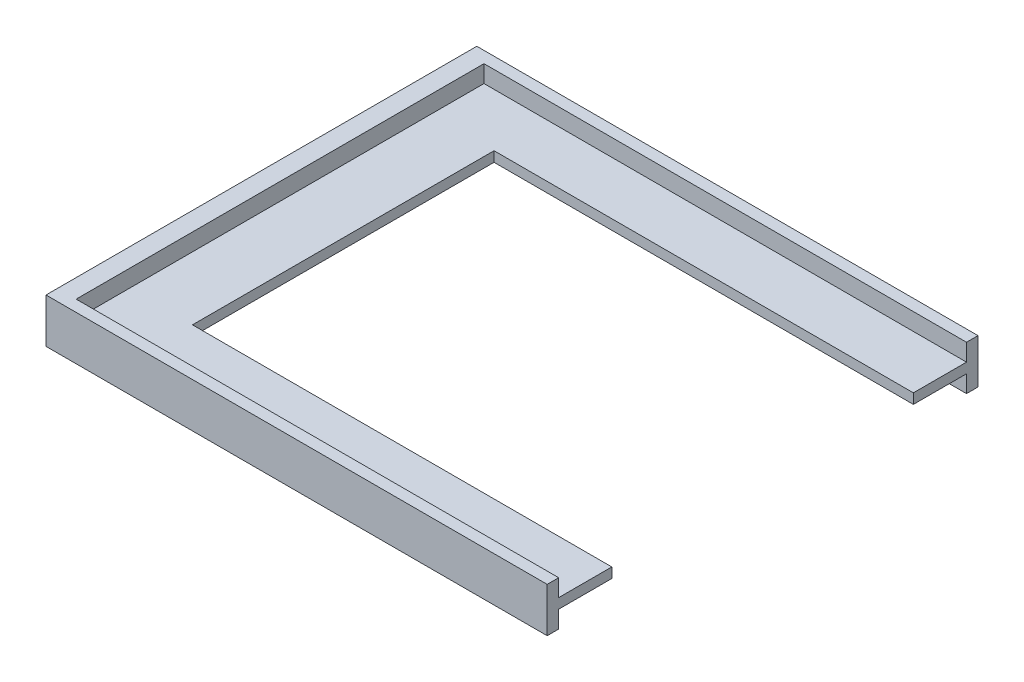
ISO-10303-21;
HEADER;
FILE_DESCRIPTION(('STEP AP214'),'2;1');
FILE_NAME('part.step','',(''),(''),'','','');
FILE_SCHEMA(('AUTOMOTIVE_DESIGN { 1 0 10303 214 1 1 1 1 }'));
ENDSEC;
DATA;
#1=APPLICATION_CONTEXT('core data for automotive mechanical design processes');
#2=APPLICATION_PROTOCOL_DEFINITION('international standard','automotive_design',2000,#1);
#3=PRODUCT_CONTEXT('',#1,'mechanical');
#4=PRODUCT('Part','Part','',(#3));
#5=PRODUCT_RELATED_PRODUCT_CATEGORY('part','',(#4));
#6=PRODUCT_DEFINITION_FORMATION('','',#4);
#7=PRODUCT_DEFINITION_CONTEXT('part definition',#1,'design');
#8=PRODUCT_DEFINITION('design','',#6,#7);
#9=PRODUCT_DEFINITION_SHAPE('','',#8);
#10=(LENGTH_UNIT() NAMED_UNIT(*) SI_UNIT(.MILLI.,.METRE.));
#11=(NAMED_UNIT(*) PLANE_ANGLE_UNIT() SI_UNIT($,.RADIAN.));
#12=(NAMED_UNIT(*) SI_UNIT($,.STERADIAN.) SOLID_ANGLE_UNIT());
#13=UNCERTAINTY_MEASURE_WITH_UNIT(LENGTH_MEASURE(1.E-05),#10,'distance_accuracy_value','');
#14=(GEOMETRIC_REPRESENTATION_CONTEXT(3) GLOBAL_UNCERTAINTY_ASSIGNED_CONTEXT((#13)) GLOBAL_UNIT_ASSIGNED_CONTEXT((#10,
#11,#12)) REPRESENTATION_CONTEXT('',''));
#15=CARTESIAN_POINT('',(0.,0.,0.));
#16=DIRECTION('',(0.,0.,1.));
#17=DIRECTION('',(1.,0.,0.));
#18=AXIS2_PLACEMENT_3D('',#15,#16,#17);
#19=CARTESIAN_POINT('',(-53.,1.4,0.));
#20=DIRECTION('',(-1.,0.,0.));
#21=DIRECTION('',(0.,0.,1.));
#22=AXIS2_PLACEMENT_3D('',#19,#20,#21);
#23=PLANE('',#22);
#24=DIRECTION('',(0.,0.,-1.));
#25=VECTOR('',#24,1.);
#26=CARTESIAN_POINT('',(-53.,0.,0.));
#27=LINE('',#26,#25);
#28=CARTESIAN_POINT('',(-53.,0.,0.));
#29=VERTEX_POINT('',#28);
#30=CARTESIAN_POINT('',(-53.,0.,-42.));
#31=VERTEX_POINT('',#30);
#32=EDGE_CURVE('E227',#29,#31,#27,.T.);
#33=ORIENTED_EDGE('',*,*,#32,.T.);
#34=DIRECTION('',(0.,-1.,0.));
#35=VECTOR('',#34,1.);
#36=CARTESIAN_POINT('',(-53.,1.4,-42.));
#37=LINE('',#36,#35);
#38=CARTESIAN_POINT('',(-53.,1.4,-42.));
#39=VERTEX_POINT('',#38);
#40=EDGE_CURVE('E261',#39,#31,#37,.T.);
#41=ORIENTED_EDGE('',*,*,#40,.F.);
#42=DIRECTION('',(0.,0.,-1.));
#43=VECTOR('',#42,1.);
#44=CARTESIAN_POINT('',(-53.,1.4,0.));
#45=LINE('',#44,#43);
#46=CARTESIAN_POINT('',(-53.,1.4,0.));
#47=VERTEX_POINT('',#46);
#48=EDGE_CURVE('E231',#47,#39,#45,.T.);
#49=ORIENTED_EDGE('',*,*,#48,.F.);
#50=DIRECTION('',(0.,-1.,0.));
#51=VECTOR('',#50,1.);
#52=CARTESIAN_POINT('',(-53.,1.4,0.));
#53=LINE('',#52,#51);
#54=EDGE_CURVE('E264',#47,#29,#53,.T.);
#55=ORIENTED_EDGE('',*,*,#54,.T.);
#56=EDGE_LOOP('',(#33,#41,#49,#55));
#57=FACE_BOUND('',#56,.T.);
#58=ADVANCED_FACE('F37',(#57),#23,.F.);
#59=CARTESIAN_POINT('',(0.,1.4,-42.));
#60=DIRECTION('',(0.,0.,-1.));
#61=DIRECTION('',(-1.,0.,0.));
#62=AXIS2_PLACEMENT_3D('',#59,#60,#61);
#63=PLANE('',#62);
#64=DIRECTION('',(1.,0.,0.));
#65=VECTOR('',#64,1.);
#66=CARTESIAN_POINT('',(0.,0.,-42.));
#67=LINE('',#66,#65);
#68=CARTESIAN_POINT('',(5.4,0.,-42.));
#69=VERTEX_POINT('',#68);
#70=EDGE_CURVE('E243',#31,#69,#67,.T.);
#71=ORIENTED_EDGE('',*,*,#70,.T.);
#72=DIRECTION('',(0.,-1.,0.));
#73=VECTOR('',#72,1.);
#74=CARTESIAN_POINT('',(5.4,1.4,-42.));
#75=LINE('',#74,#73);
#76=CARTESIAN_POINT('',(5.4,1.4,-42.));
#77=VERTEX_POINT('',#76);
#78=EDGE_CURVE('E258',#77,#69,#75,.T.);
#79=ORIENTED_EDGE('',*,*,#78,.F.);
#80=DIRECTION('',(1.,0.,0.));
#81=VECTOR('',#80,1.);
#82=CARTESIAN_POINT('',(-53.,1.4,-42.));
#83=LINE('',#82,#81);
#84=EDGE_CURVE('E234',#39,#77,#83,.T.);
#85=ORIENTED_EDGE('',*,*,#84,.F.);
#86=ORIENTED_EDGE('',*,*,#40,.T.);
#87=EDGE_LOOP('',(#71,#79,#85,#86));
#88=FACE_BOUND('',#87,.T.);
#89=ADVANCED_FACE('F322',(#88),#63,.F.);
#90=CARTESIAN_POINT('',(5.4,1.4,-51.));
#91=DIRECTION('',(-1.,0.,0.));
#92=DIRECTION('',(0.,0.,1.));
#93=AXIS2_PLACEMENT_3D('',#90,#91,#92);
#94=PLANE('',#93);
#95=DIRECTION('',(0.,0.,-1.));
#96=VECTOR('',#95,1.);
#97=CARTESIAN_POINT('',(5.4,0.,-51.));
#98=LINE('',#97,#96);
#99=CARTESIAN_POINT('',(5.4,0.,-49.4));
#100=VERTEX_POINT('',#99);
#101=EDGE_CURVE('E246',#69,#100,#98,.T.);
#102=ORIENTED_EDGE('',*,*,#101,.T.);
#103=DIRECTION('',(0.,1.,0.));
#104=VECTOR('',#103,1.);
#105=CARTESIAN_POINT('',(5.4,-2.4,-49.4));
#106=LINE('',#105,#104);
#107=CARTESIAN_POINT('',(5.4,-2.4,-49.4));
#108=VERTEX_POINT('',#107);
#109=EDGE_CURVE('E209',#108,#100,#106,.T.);
#110=ORIENTED_EDGE('',*,*,#109,.F.);
#111=DIRECTION('',(0.,0.,-1.));
#112=VECTOR('',#111,1.);
#113=CARTESIAN_POINT('',(5.4,-2.4,-51.));
#114=LINE('',#113,#112);
#115=CARTESIAN_POINT('',(5.4,-2.4,-51.));
#116=VERTEX_POINT('',#115);
#117=EDGE_CURVE('E202',#108,#116,#114,.T.);
#118=ORIENTED_EDGE('',*,*,#117,.T.);
#119=DIRECTION('',(0.,-1.,0.));
#120=VECTOR('',#119,1.);
#121=CARTESIAN_POINT('',(5.4,1.4,-51.));
#122=LINE('',#121,#120);
#123=CARTESIAN_POINT('',(5.4,3.8,-51.));
#124=VERTEX_POINT('',#123);
#125=EDGE_CURVE('E256',#124,#116,#122,.T.);
#126=ORIENTED_EDGE('',*,*,#125,.F.);
#127=DIRECTION('',(0.,0.,-1.));
#128=VECTOR('',#127,1.);
#129=CARTESIAN_POINT('',(5.4,3.8,-51.));
#130=LINE('',#129,#128);
#131=CARTESIAN_POINT('',(5.4,3.8,-49.4));
#132=VERTEX_POINT('',#131);
#133=EDGE_CURVE('E184',#132,#124,#130,.T.);
#134=ORIENTED_EDGE('',*,*,#133,.F.);
#135=CARTESIAN_POINT('',(5.4,1.4,-49.4));
#136=VERTEX_POINT('',#135);
#137=EDGE_CURVE('E212',#136,#132,#106,.T.);
#138=ORIENTED_EDGE('',*,*,#137,.F.);
#139=DIRECTION('',(0.,0.,-1.));
#140=VECTOR('',#139,1.);
#141=CARTESIAN_POINT('',(5.4,1.4,-42.));
#142=LINE('',#141,#140);
#143=EDGE_CURVE('E236',#77,#136,#142,.T.);
#144=ORIENTED_EDGE('',*,*,#143,.F.);
#145=ORIENTED_EDGE('',*,*,#78,.T.);
#146=EDGE_LOOP('',(#102,#110,#118,#126,#134,#138,#144,#145));
#147=FACE_BOUND('',#146,.T.);
#148=ADVANCED_FACE('F307',(#147),#94,.F.);
#149=CARTESIAN_POINT('',(-64.4,1.4,-51.));
#150=DIRECTION('',(0.,0.,1.));
#151=DIRECTION('',(1.,0.,0.));
#152=AXIS2_PLACEMENT_3D('',#149,#150,#151);
#153=PLANE('',#152);
#154=ORIENTED_EDGE('',*,*,#125,.T.);
#155=DIRECTION('',(-1.,0.,0.));
#156=VECTOR('',#155,1.);
#157=CARTESIAN_POINT('',(-64.4,-2.4,-51.));
#158=LINE('',#157,#156);
#159=CARTESIAN_POINT('',(-64.4,-2.4,-51.));
#160=VERTEX_POINT('',#159);
#161=EDGE_CURVE('E205',#116,#160,#158,.T.);
#162=ORIENTED_EDGE('',*,*,#161,.T.);
#163=DIRECTION('',(0.,-1.,0.));
#164=VECTOR('',#163,1.);
#165=CARTESIAN_POINT('',(-64.4,1.4,-51.));
#166=LINE('',#165,#164);
#167=CARTESIAN_POINT('',(-64.4,3.8,-51.));
#168=VERTEX_POINT('',#167);
#169=EDGE_CURVE('E156',#168,#160,#166,.T.);
#170=ORIENTED_EDGE('',*,*,#169,.F.);
#171=DIRECTION('',(-1.,0.,0.));
#172=VECTOR('',#171,1.);
#173=CARTESIAN_POINT('',(-64.4,3.8,-51.));
#174=LINE('',#173,#172);
#175=EDGE_CURVE('E171',#124,#168,#174,.T.);
#176=ORIENTED_EDGE('',*,*,#175,.F.);
#177=EDGE_LOOP('',(#154,#162,#170,#176));
#178=FACE_BOUND('',#177,.T.);
#179=ADVANCED_FACE('F312',(#178),#153,.F.);
#180=CARTESIAN_POINT('',(-64.4,1.4,8.99999999999999));
#181=DIRECTION('',(1.,0.,0.));
#182=DIRECTION('',(0.,0.,-1.));
#183=AXIS2_PLACEMENT_3D('',#180,#181,#182);
#184=PLANE('',#183);
#185=ORIENTED_EDGE('',*,*,#169,.T.);
#186=DIRECTION('',(0.,0.,1.));
#187=VECTOR('',#186,1.);
#188=CARTESIAN_POINT('',(-64.4,-2.4,-51.));
#189=LINE('',#188,#187);
#190=CARTESIAN_POINT('',(-64.4,-2.4,8.99999999999999));
#191=VERTEX_POINT('',#190);
#192=EDGE_CURVE('E152',#160,#191,#189,.T.);
#193=ORIENTED_EDGE('',*,*,#192,.T.);
#194=DIRECTION('',(0.,-1.,0.));
#195=VECTOR('',#194,1.);
#196=CARTESIAN_POINT('',(-64.4,1.4,8.99999999999999));
#197=LINE('',#196,#195);
#198=CARTESIAN_POINT('',(-64.4,3.8,8.99999999999999));
#199=VERTEX_POINT('',#198);
#200=EDGE_CURVE('E146',#199,#191,#197,.T.);
#201=ORIENTED_EDGE('',*,*,#200,.F.);
#202=DIRECTION('',(0.,0.,1.));
#203=VECTOR('',#202,1.);
#204=CARTESIAN_POINT('',(-64.4,3.8,-51.));
#205=LINE('',#204,#203);
#206=EDGE_CURVE('E150',#168,#199,#205,.T.);
#207=ORIENTED_EDGE('',*,*,#206,.F.);
#208=EDGE_LOOP('',(#185,#193,#201,#207));
#209=FACE_BOUND('',#208,.T.);
#210=ADVANCED_FACE('F148',(#209),#184,.F.);
#211=CARTESIAN_POINT('',(-58.4,1.4,8.99999999999999));
#212=DIRECTION('',(0.,0.,-1.));
#213=DIRECTION('',(-1.,0.,0.));
#214=AXIS2_PLACEMENT_3D('',#211,#212,#213);
#215=PLANE('',#214);
#216=ORIENTED_EDGE('',*,*,#200,.T.);
#217=DIRECTION('',(1.,0.,0.));
#218=VECTOR('',#217,1.);
#219=CARTESIAN_POINT('',(-64.4,-2.4,8.99999999999999));
#220=LINE('',#219,#218);
#221=CARTESIAN_POINT('',(5.4,-2.4,8.99999999999999));
#222=VERTEX_POINT('',#221);
#223=EDGE_CURVE('E188',#191,#222,#220,.T.);
#224=ORIENTED_EDGE('',*,*,#223,.T.);
#225=DIRECTION('',(0.,-1.,0.));
#226=VECTOR('',#225,1.);
#227=CARTESIAN_POINT('',(5.4,1.4,8.99999999999999));
#228=LINE('',#227,#226);
#229=CARTESIAN_POINT('',(5.4,3.8,8.99999999999999));
#230=VERTEX_POINT('',#229);
#231=EDGE_CURVE('E157',#230,#222,#228,.T.);
#232=ORIENTED_EDGE('',*,*,#231,.F.);
#233=DIRECTION('',(1.,0.,0.));
#234=VECTOR('',#233,1.);
#235=CARTESIAN_POINT('',(-64.4,3.8,8.99999999999999));
#236=LINE('',#235,#234);
#237=EDGE_CURVE('E160',#199,#230,#236,.T.);
#238=ORIENTED_EDGE('',*,*,#237,.F.);
#239=EDGE_LOOP('',(#216,#224,#232,#238));
#240=FACE_BOUND('',#239,.T.);
#241=ADVANCED_FACE('F161',(#240),#215,.F.);
#242=CARTESIAN_POINT('',(5.4,1.4,0.));
#243=DIRECTION('',(-1.,0.,0.));
#244=DIRECTION('',(0.,0.,1.));
#245=AXIS2_PLACEMENT_3D('',#242,#243,#244);
#246=PLANE('',#245);
#247=DIRECTION('',(0.,0.,-1.));
#248=VECTOR('',#247,1.);
#249=CARTESIAN_POINT('',(5.4,1.4,8.99999999999999));
#250=LINE('',#249,#248);
#251=CARTESIAN_POINT('',(5.40000000000001,1.4,7.39999999999999));
#252=VERTEX_POINT('',#251);
#253=CARTESIAN_POINT('',(5.4,1.4,0.));
#254=VERTEX_POINT('',#253);
#255=EDGE_CURVE('E238',#252,#254,#250,.T.);
#256=ORIENTED_EDGE('',*,*,#255,.F.);
#257=DIRECTION('',(0.,1.,0.));
#258=VECTOR('',#257,1.);
#259=CARTESIAN_POINT('',(5.40000000000001,-2.4,7.39999999999999));
#260=LINE('',#259,#258);
#261=CARTESIAN_POINT('',(5.40000000000001,3.8,7.39999999999999));
#262=VERTEX_POINT('',#261);
#263=EDGE_CURVE('E208',#252,#262,#260,.T.);
#264=ORIENTED_EDGE('',*,*,#263,.T.);
#265=DIRECTION('',(0.,0.,-1.));
#266=VECTOR('',#265,1.);
#267=CARTESIAN_POINT('',(5.4,3.8,8.99999999999999));
#268=LINE('',#267,#266);
#269=EDGE_CURVE('E165',#230,#262,#268,.T.);
#270=ORIENTED_EDGE('',*,*,#269,.F.);
#271=ORIENTED_EDGE('',*,*,#231,.T.);
#272=DIRECTION('',(0.,0.,-1.));
#273=VECTOR('',#272,1.);
#274=CARTESIAN_POINT('',(5.4,-2.4,8.99999999999999));
#275=LINE('',#274,#273);
#276=CARTESIAN_POINT('',(5.40000000000001,-2.4,7.39999999999999));
#277=VERTEX_POINT('',#276);
#278=EDGE_CURVE('E190',#222,#277,#275,.T.);
#279=ORIENTED_EDGE('',*,*,#278,.T.);
#280=CARTESIAN_POINT('',(5.40000000000001,0.,7.39999999999999));
#281=VERTEX_POINT('',#280);
#282=EDGE_CURVE('E221',#277,#281,#260,.T.);
#283=ORIENTED_EDGE('',*,*,#282,.T.);
#284=DIRECTION('',(0.,0.,-1.));
#285=VECTOR('',#284,1.);
#286=CARTESIAN_POINT('',(5.4,0.,0.));
#287=LINE('',#286,#285);
#288=CARTESIAN_POINT('',(5.4,0.,0.));
#289=VERTEX_POINT('',#288);
#290=EDGE_CURVE('E249',#281,#289,#287,.T.);
#291=ORIENTED_EDGE('',*,*,#290,.T.);
#292=DIRECTION('',(0.,-1.,0.));
#293=VECTOR('',#292,1.);
#294=CARTESIAN_POINT('',(5.4,1.4,0.));
#295=LINE('',#294,#293);
#296=EDGE_CURVE('E240',#254,#289,#295,.T.);
#297=ORIENTED_EDGE('',*,*,#296,.F.);
#298=EDGE_LOOP('',(#256,#264,#270,#271,#279,#283,#291,#297));
#299=FACE_BOUND('',#298,.T.);
#300=ADVANCED_FACE('F285',(#299),#246,.F.);
#301=CARTESIAN_POINT('',(0.,1.4,0.));
#302=DIRECTION('',(0.,0.,1.));
#303=DIRECTION('',(1.,0.,0.));
#304=AXIS2_PLACEMENT_3D('',#301,#302,#303);
#305=PLANE('',#304);
#306=DIRECTION('',(-1.,0.,0.));
#307=VECTOR('',#306,1.);
#308=CARTESIAN_POINT('',(0.,0.,0.));
#309=LINE('',#308,#307);
#310=EDGE_CURVE('E232',#289,#29,#309,.T.);
#311=ORIENTED_EDGE('',*,*,#310,.T.);
#312=ORIENTED_EDGE('',*,*,#54,.F.);
#313=DIRECTION('',(-1.,0.,0.));
#314=VECTOR('',#313,1.);
#315=CARTESIAN_POINT('',(0.,1.4,0.));
#316=LINE('',#315,#314);
#317=EDGE_CURVE('E228',#254,#47,#316,.T.);
#318=ORIENTED_EDGE('',*,*,#317,.F.);
#319=ORIENTED_EDGE('',*,*,#296,.T.);
#320=EDGE_LOOP('',(#311,#312,#318,#319));
#321=FACE_BOUND('',#320,.T.);
#322=ADVANCED_FACE('F288',(#321),#305,.F.);
#323=CARTESIAN_POINT('',(0.,1.4,0.));
#324=DIRECTION('',(0.,-1.,0.));
#325=DIRECTION('',(0.,0.,-1.));
#326=AXIS2_PLACEMENT_3D('',#323,#324,#325);
#327=PLANE('',#326);
#328=ORIENTED_EDGE('',*,*,#143,.T.);
#329=DIRECTION('',(-1.,0.,0.));
#330=VECTOR('',#329,1.);
#331=CARTESIAN_POINT('',(0.,1.4,-49.4));
#332=LINE('',#331,#330);
#333=CARTESIAN_POINT('',(-61.8,1.4,-49.4));
#334=VERTEX_POINT('',#333);
#335=EDGE_CURVE('E51',#136,#334,#332,.T.);
#336=ORIENTED_EDGE('',*,*,#335,.T.);
#337=DIRECTION('',(0.,0.,1.));
#338=VECTOR('',#337,1.);
#339=CARTESIAN_POINT('',(-61.8,1.4,0.));
#340=LINE('',#339,#338);
#341=CARTESIAN_POINT('',(-61.8,1.4,7.39999999999999));
#342=VERTEX_POINT('',#341);
#343=EDGE_CURVE('E55',#334,#342,#340,.T.);
#344=ORIENTED_EDGE('',*,*,#343,.T.);
#345=DIRECTION('',(1.,0.,0.));
#346=VECTOR('',#345,1.);
#347=CARTESIAN_POINT('',(0.,1.4,7.39999999999999));
#348=LINE('',#347,#346);
#349=EDGE_CURVE('E211',#342,#252,#348,.T.);
#350=ORIENTED_EDGE('',*,*,#349,.T.);
#351=ORIENTED_EDGE('',*,*,#255,.T.);
#352=ORIENTED_EDGE('',*,*,#317,.T.);
#353=ORIENTED_EDGE('',*,*,#48,.T.);
#354=ORIENTED_EDGE('',*,*,#84,.T.);
#355=EDGE_LOOP('',(#328,#336,#344,#350,#351,#352,#353,#354));
#356=FACE_BOUND('',#355,.T.);
#357=ADVANCED_FACE('F290',(#356),#327,.F.);
#358=CARTESIAN_POINT('',(0.,0.,0.));
#359=DIRECTION('',(0.,-1.,0.));
#360=DIRECTION('',(0.,0.,-1.));
#361=AXIS2_PLACEMENT_3D('',#358,#359,#360);
#362=PLANE('',#361);
#363=DIRECTION('',(-1.,0.,0.));
#364=VECTOR('',#363,1.);
#365=CARTESIAN_POINT('',(0.,0.,-49.4));
#366=LINE('',#365,#364);
#367=CARTESIAN_POINT('',(-61.8,0.,-49.4));
#368=VERTEX_POINT('',#367);
#369=EDGE_CURVE('E11',#100,#368,#366,.T.);
#370=ORIENTED_EDGE('',*,*,#369,.F.);
#371=ORIENTED_EDGE('',*,*,#101,.F.);
#372=ORIENTED_EDGE('',*,*,#70,.F.);
#373=ORIENTED_EDGE('',*,*,#32,.F.);
#374=ORIENTED_EDGE('',*,*,#310,.F.);
#375=ORIENTED_EDGE('',*,*,#290,.F.);
#376=DIRECTION('',(1.,0.,0.));
#377=VECTOR('',#376,1.);
#378=CARTESIAN_POINT('',(0.,0.,7.39999999999999));
#379=LINE('',#378,#377);
#380=CARTESIAN_POINT('',(-61.8,0.,7.39999999999999));
#381=VERTEX_POINT('',#380);
#382=EDGE_CURVE('E267',#381,#281,#379,.T.);
#383=ORIENTED_EDGE('',*,*,#382,.F.);
#384=DIRECTION('',(0.,0.,1.));
#385=VECTOR('',#384,1.);
#386=CARTESIAN_POINT('',(-61.8,0.,0.));
#387=LINE('',#386,#385);
#388=EDGE_CURVE('E44',#368,#381,#387,.T.);
#389=ORIENTED_EDGE('',*,*,#388,.F.);
#390=EDGE_LOOP('',(#370,#371,#372,#373,#374,#375,#383,#389));
#391=FACE_BOUND('',#390,.T.);
#392=ADVANCED_FACE('F279',(#391),#362,.T.);
#393=CARTESIAN_POINT('',(0.,-2.4,0.));
#394=DIRECTION('',(0.,1.,0.));
#395=DIRECTION('',(0.,0.,1.));
#396=AXIS2_PLACEMENT_3D('',#393,#394,#395);
#397=PLANE('',#396);
#398=ORIENTED_EDGE('',*,*,#192,.F.);
#399=ORIENTED_EDGE('',*,*,#161,.F.);
#400=ORIENTED_EDGE('',*,*,#117,.F.);
#401=DIRECTION('',(1.,0.,0.));
#402=VECTOR('',#401,1.);
#403=CARTESIAN_POINT('',(-61.8,-2.4,-49.4));
#404=LINE('',#403,#402);
#405=CARTESIAN_POINT('',(-61.8,-2.4,-49.4));
#406=VERTEX_POINT('',#405);
#407=EDGE_CURVE('E199',#406,#108,#404,.T.);
#408=ORIENTED_EDGE('',*,*,#407,.F.);
#409=DIRECTION('',(0.,0.,-1.));
#410=VECTOR('',#409,1.);
#411=CARTESIAN_POINT('',(-61.8,-2.4,-49.4));
#412=LINE('',#411,#410);
#413=CARTESIAN_POINT('',(-61.8,-2.4,7.39999999999999));
#414=VERTEX_POINT('',#413);
#415=EDGE_CURVE('E196',#414,#406,#412,.T.);
#416=ORIENTED_EDGE('',*,*,#415,.F.);
#417=DIRECTION('',(-1.,0.,0.));
#418=VECTOR('',#417,1.);
#419=CARTESIAN_POINT('',(-61.8,-2.4,7.39999999999999));
#420=LINE('',#419,#418);
#421=EDGE_CURVE('E193',#277,#414,#420,.T.);
#422=ORIENTED_EDGE('',*,*,#421,.F.);
#423=ORIENTED_EDGE('',*,*,#278,.F.);
#424=ORIENTED_EDGE('',*,*,#223,.F.);
#425=EDGE_LOOP('',(#398,#399,#400,#408,#416,#422,#423,#424));
#426=FACE_BOUND('',#425,.T.);
#427=ADVANCED_FACE('F314',(#426),#397,.F.);
#428=CARTESIAN_POINT('',(-61.8,-2.4,7.39999999999999));
#429=DIRECTION('',(0.,0.,-1.));
#430=DIRECTION('',(-1.,0.,0.));
#431=AXIS2_PLACEMENT_3D('',#428,#429,#430);
#432=PLANE('',#431);
#433=DIRECTION('',(0.,1.,0.));
#434=VECTOR('',#433,1.);
#435=CARTESIAN_POINT('',(-61.8,-2.4,7.39999999999999));
#436=LINE('',#435,#434);
#437=EDGE_CURVE('E217',#414,#381,#436,.T.);
#438=ORIENTED_EDGE('',*,*,#437,.T.);
#439=ORIENTED_EDGE('',*,*,#382,.T.);
#440=ORIENTED_EDGE('',*,*,#282,.F.);
#441=ORIENTED_EDGE('',*,*,#421,.T.);
#442=EDGE_LOOP('',(#438,#439,#440,#441));
#443=FACE_BOUND('',#442,.T.);
#444=ADVANCED_FACE('F276',(#443),#432,.T.);
#445=CARTESIAN_POINT('',(-61.8,-2.4,-49.4));
#446=DIRECTION('',(1.,0.,0.));
#447=DIRECTION('',(0.,0.,-1.));
#448=AXIS2_PLACEMENT_3D('',#445,#446,#447);
#449=PLANE('',#448);
#450=DIRECTION('',(0.,1.,0.));
#451=VECTOR('',#450,1.);
#452=CARTESIAN_POINT('',(-61.8,-2.4,-49.4));
#453=LINE('',#452,#451);
#454=EDGE_CURVE('E213',#406,#368,#453,.T.);
#455=ORIENTED_EDGE('',*,*,#454,.T.);
#456=ORIENTED_EDGE('',*,*,#388,.T.);
#457=ORIENTED_EDGE('',*,*,#437,.F.);
#458=ORIENTED_EDGE('',*,*,#415,.T.);
#459=EDGE_LOOP('',(#455,#456,#457,#458));
#460=FACE_BOUND('',#459,.T.);
#461=ADVANCED_FACE('F270',(#460),#449,.T.);
#462=CARTESIAN_POINT('',(-61.8,-2.4,-49.4));
#463=DIRECTION('',(0.,0.,1.));
#464=DIRECTION('',(1.,0.,0.));
#465=AXIS2_PLACEMENT_3D('',#462,#463,#464);
#466=PLANE('',#465);
#467=ORIENTED_EDGE('',*,*,#109,.T.);
#468=ORIENTED_EDGE('',*,*,#369,.T.);
#469=ORIENTED_EDGE('',*,*,#454,.F.);
#470=ORIENTED_EDGE('',*,*,#407,.T.);
#471=EDGE_LOOP('',(#467,#468,#469,#470));
#472=FACE_BOUND('',#471,.T.);
#473=ADVANCED_FACE('F318',(#472),#466,.T.);
#474=ORIENTED_EDGE('',*,*,#335,.F.);
#475=ORIENTED_EDGE('',*,*,#137,.T.);
#476=DIRECTION('',(1.,0.,0.));
#477=VECTOR('',#476,1.);
#478=CARTESIAN_POINT('',(-61.8,3.8,-49.4));
#479=LINE('',#478,#477);
#480=CARTESIAN_POINT('',(-61.8,3.8,-49.4));
#481=VERTEX_POINT('',#480);
#482=EDGE_CURVE('E181',#481,#132,#479,.T.);
#483=ORIENTED_EDGE('',*,*,#482,.F.);
#484=EDGE_CURVE('E216',#334,#481,#453,.T.);
#485=ORIENTED_EDGE('',*,*,#484,.F.);
#486=EDGE_LOOP('',(#474,#475,#483,#485));
#487=FACE_BOUND('',#486,.T.);
#488=ADVANCED_FACE('F303',(#487),#466,.T.);
#489=ORIENTED_EDGE('',*,*,#343,.F.);
#490=ORIENTED_EDGE('',*,*,#484,.T.);
#491=DIRECTION('',(0.,0.,-1.));
#492=VECTOR('',#491,1.);
#493=CARTESIAN_POINT('',(-61.8,3.8,-49.4));
#494=LINE('',#493,#492);
#495=CARTESIAN_POINT('',(-61.8,3.8,7.39999999999999));
#496=VERTEX_POINT('',#495);
#497=EDGE_CURVE('E178',#496,#481,#494,.T.);
#498=ORIENTED_EDGE('',*,*,#497,.F.);
#499=EDGE_CURVE('E220',#342,#496,#436,.T.);
#500=ORIENTED_EDGE('',*,*,#499,.F.);
#501=EDGE_LOOP('',(#489,#490,#498,#500));
#502=FACE_BOUND('',#501,.T.);
#503=ADVANCED_FACE('F300',(#502),#449,.T.);
#504=ORIENTED_EDGE('',*,*,#349,.F.);
#505=ORIENTED_EDGE('',*,*,#499,.T.);
#506=DIRECTION('',(-1.,0.,0.));
#507=VECTOR('',#506,1.);
#508=CARTESIAN_POINT('',(-61.8,3.8,7.39999999999999));
#509=LINE('',#508,#507);
#510=EDGE_CURVE('E175',#262,#496,#509,.T.);
#511=ORIENTED_EDGE('',*,*,#510,.F.);
#512=ORIENTED_EDGE('',*,*,#263,.F.);
#513=EDGE_LOOP('',(#504,#505,#511,#512));
#514=FACE_BOUND('',#513,.T.);
#515=ADVANCED_FACE('F295',(#514),#432,.T.);
#516=CARTESIAN_POINT('',(0.,3.8,0.));
#517=DIRECTION('',(0.,1.,0.));
#518=DIRECTION('',(0.,0.,1.));
#519=AXIS2_PLACEMENT_3D('',#516,#517,#518);
#520=PLANE('',#519);
#521=ORIENTED_EDGE('',*,*,#206,.T.);
#522=ORIENTED_EDGE('',*,*,#237,.T.);
#523=ORIENTED_EDGE('',*,*,#269,.T.);
#524=ORIENTED_EDGE('',*,*,#510,.T.);
#525=ORIENTED_EDGE('',*,*,#497,.T.);
#526=ORIENTED_EDGE('',*,*,#482,.T.);
#527=ORIENTED_EDGE('',*,*,#133,.T.);
#528=ORIENTED_EDGE('',*,*,#175,.T.);
#529=EDGE_LOOP('',(#521,#522,#523,#524,#525,#526,#527,#528));
#530=FACE_BOUND('',#529,.T.);
#531=ADVANCED_FACE('F168',(#530),#520,.T.);
#532=CLOSED_SHELL('',(#58,#89,#148,#179,#210,#241,#300,#322,#357,#392,#427,#444,#461,#473,#488,
#503,#515,#531));
#533=MANIFOLD_SOLID_BREP('B2',#532);
#534=ADVANCED_BREP_SHAPE_REPRESENTATION('',(#18,#533),#14);
#535=SHAPE_DEFINITION_REPRESENTATION(#9,#534);
ENDSEC;
END-ISO-10303-21;
